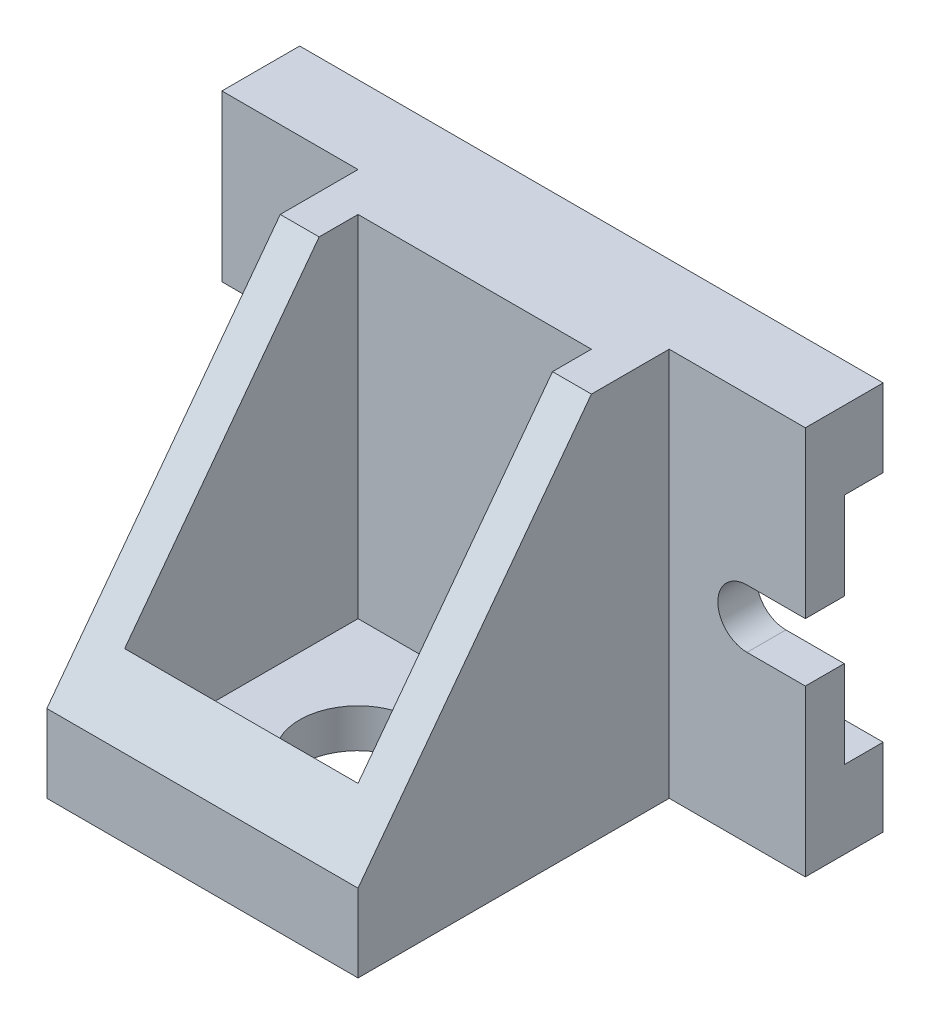
ISO-10303-21;
HEADER;
FILE_DESCRIPTION(('STEP AP214'),'2;1');
FILE_NAME('part.step','',(''),(''),'','','');
FILE_SCHEMA(('AUTOMOTIVE_DESIGN { 1 0 10303 214 1 1 1 1 }'));
ENDSEC;
DATA;
#1=APPLICATION_CONTEXT('core data for automotive mechanical design processes');
#2=APPLICATION_PROTOCOL_DEFINITION('international standard','automotive_design',2000,#1);
#3=PRODUCT_CONTEXT('',#1,'mechanical');
#4=PRODUCT('Part','Part','',(#3));
#5=PRODUCT_RELATED_PRODUCT_CATEGORY('part','',(#4));
#6=PRODUCT_DEFINITION_FORMATION('','',#4);
#7=PRODUCT_DEFINITION_CONTEXT('part definition',#1,'design');
#8=PRODUCT_DEFINITION('design','',#6,#7);
#9=PRODUCT_DEFINITION_SHAPE('','',#8);
#10=(LENGTH_UNIT() NAMED_UNIT(*) SI_UNIT(.MILLI.,.METRE.));
#11=(NAMED_UNIT(*) PLANE_ANGLE_UNIT() SI_UNIT($,.RADIAN.));
#12=(NAMED_UNIT(*) SI_UNIT($,.STERADIAN.) SOLID_ANGLE_UNIT());
#13=UNCERTAINTY_MEASURE_WITH_UNIT(LENGTH_MEASURE(1.E-05),#10,'distance_accuracy_value','');
#14=(GEOMETRIC_REPRESENTATION_CONTEXT(3) GLOBAL_UNCERTAINTY_ASSIGNED_CONTEXT((#13)) GLOBAL_UNIT_ASSIGNED_CONTEXT((#10,
#11,#12)) REPRESENTATION_CONTEXT('',''));
#15=CARTESIAN_POINT('',(0.,0.,0.));
#16=DIRECTION('',(0.,0.,1.));
#17=DIRECTION('',(1.,0.,0.));
#18=AXIS2_PLACEMENT_3D('',#15,#16,#17);
#19=CARTESIAN_POINT('',(-75.,-7.5,20.));
#20=DIRECTION('',(1.,0.,0.));
#21=DIRECTION('',(0.,0.,-1.));
#22=AXIS2_PLACEMENT_3D('',#19,#20,#21);
#23=PLANE('',#22);
#24=DIRECTION('',(0.,0.,-1.));
#25=VECTOR('',#24,1.);
#26=CARTESIAN_POINT('',(-75.,-50.,20.));
#27=LINE('',#26,#25);
#28=CARTESIAN_POINT('',(-75.,-50.,20.));
#29=VERTEX_POINT('',#28);
#30=CARTESIAN_POINT('',(-75.,-50.,0.));
#31=VERTEX_POINT('',#30);
#32=EDGE_CURVE('E446',#29,#31,#27,.T.);
#33=ORIENTED_EDGE('',*,*,#32,.F.);
#34=DIRECTION('',(0.,-1.,0.));
#35=VECTOR('',#34,1.);
#36=CARTESIAN_POINT('',(-75.,50.,20.));
#37=LINE('',#36,#35);
#38=CARTESIAN_POINT('',(-75.,-7.5,20.));
#39=VERTEX_POINT('',#38);
#40=EDGE_CURVE('E276',#39,#29,#37,.T.);
#41=ORIENTED_EDGE('',*,*,#40,.F.);
#42=DIRECTION('',(0.,0.,-1.));
#43=VECTOR('',#42,1.);
#44=CARTESIAN_POINT('',(-75.,-7.5,20.));
#45=LINE('',#44,#43);
#46=CARTESIAN_POINT('',(-75.,-7.5,10.));
#47=VERTEX_POINT('',#46);
#48=EDGE_CURVE('E449',#39,#47,#45,.T.);
#49=ORIENTED_EDGE('',*,*,#48,.T.);
#50=DIRECTION('',(0.,-1.,0.));
#51=VECTOR('',#50,1.);
#52=CARTESIAN_POINT('',(-75.,-7.5,10.));
#53=LINE('',#52,#51);
#54=CARTESIAN_POINT('',(-75.,-30.,10.));
#55=VERTEX_POINT('',#54);
#56=EDGE_CURVE('E487',#47,#55,#53,.T.);
#57=ORIENTED_EDGE('',*,*,#56,.T.);
#58=DIRECTION('',(0.,0.,-1.));
#59=VECTOR('',#58,1.);
#60=CARTESIAN_POINT('',(-75.,-30.,20.));
#61=LINE('',#60,#59);
#62=CARTESIAN_POINT('',(-75.,-30.,0.));
#63=VERTEX_POINT('',#62);
#64=EDGE_CURVE('E369',#55,#63,#61,.T.);
#65=ORIENTED_EDGE('',*,*,#64,.T.);
#66=DIRECTION('',(0.,-1.,0.));
#67=VECTOR('',#66,1.);
#68=CARTESIAN_POINT('',(-75.,-7.5,0.));
#69=LINE('',#68,#67);
#70=EDGE_CURVE('E437',#63,#31,#69,.T.);
#71=ORIENTED_EDGE('',*,*,#70,.T.);
#72=EDGE_LOOP('',(#33,#41,#49,#57,#65,#71));
#73=FACE_BOUND('',#72,.T.);
#74=ADVANCED_FACE('F47',(#73),#23,.F.);
#75=CARTESIAN_POINT('',(-75.,-50.,100.));
#76=DIRECTION('',(0.,0.,1.));
#77=DIRECTION('',(1.,0.,0.));
#78=AXIS2_PLACEMENT_3D('',#75,#76,#77);
#79=PLANE('',#78);
#80=DIRECTION('',(1.,0.,0.));
#81=VECTOR('',#80,1.);
#82=CARTESIAN_POINT('',(-75.,-30.,100.));
#83=LINE('',#82,#81);
#84=CARTESIAN_POINT('',(-40.,-30.,100.));
#85=VERTEX_POINT('',#84);
#86=CARTESIAN_POINT('',(40.,-30.,100.));
#87=VERTEX_POINT('',#86);
#88=EDGE_CURVE('E330',#85,#87,#83,.T.);
#89=ORIENTED_EDGE('',*,*,#88,.F.);
#90=DIRECTION('',(0.,1.,0.));
#91=VECTOR('',#90,1.);
#92=CARTESIAN_POINT('',(-40.,50.,100.));
#93=LINE('',#92,#91);
#94=CARTESIAN_POINT('',(-40.,-50.,100.));
#95=VERTEX_POINT('',#94);
#96=EDGE_CURVE('E72',#95,#85,#93,.T.);
#97=ORIENTED_EDGE('',*,*,#96,.F.);
#98=DIRECTION('',(1.,0.,0.));
#99=VECTOR('',#98,1.);
#100=CARTESIAN_POINT('',(-75.,-50.,100.));
#101=LINE('',#100,#99);
#102=CARTESIAN_POINT('',(40.,-50.,100.));
#103=VERTEX_POINT('',#102);
#104=EDGE_CURVE('E326',#95,#103,#101,.T.);
#105=ORIENTED_EDGE('',*,*,#104,.T.);
#106=DIRECTION('',(0.,-1.,0.));
#107=VECTOR('',#106,1.);
#108=CARTESIAN_POINT('',(40.,50.,100.));
#109=LINE('',#108,#107);
#110=EDGE_CURVE('E307',#87,#103,#109,.T.);
#111=ORIENTED_EDGE('',*,*,#110,.F.);
#112=EDGE_LOOP('',(#89,#97,#105,#111));
#113=FACE_BOUND('',#112,.T.);
#114=ADVANCED_FACE('F594',(#113),#79,.T.);
#115=CARTESIAN_POINT('',(-75.,-30.,100.));
#116=DIRECTION('',(0.,0.6,0.8));
#117=DIRECTION('',(0.,-0.8,0.6));
#118=AXIS2_PLACEMENT_3D('',#115,#116,#117);
#119=PLANE('',#118);
#120=DIRECTION('',(0.,-0.8,0.6));
#121=VECTOR('',#120,1.);
#122=CARTESIAN_POINT('',(-30.,-30.,100.));
#123=LINE('',#122,#121);
#124=CARTESIAN_POINT('',(-30.,50.,40.));
#125=VERTEX_POINT('',#124);
#126=CARTESIAN_POINT('',(-30.,-16.6666666666666,90.));
#127=VERTEX_POINT('',#126);
#128=EDGE_CURVE('E229',#125,#127,#123,.T.);
#129=ORIENTED_EDGE('',*,*,#128,.F.);
#130=DIRECTION('',(1.,0.,0.));
#131=VECTOR('',#130,1.);
#132=CARTESIAN_POINT('',(-75.,50.,40.));
#133=LINE('',#132,#131);
#134=CARTESIAN_POINT('',(-40.,50.,40.));
#135=VERTEX_POINT('',#134);
#136=EDGE_CURVE('E333',#135,#125,#133,.T.);
#137=ORIENTED_EDGE('',*,*,#136,.F.);
#138=DIRECTION('',(0.,-0.8,0.6));
#139=VECTOR('',#138,1.);
#140=CARTESIAN_POINT('',(-40.,-30.,100.));
#141=LINE('',#140,#139);
#142=EDGE_CURVE('E495',#135,#85,#141,.T.);
#143=ORIENTED_EDGE('',*,*,#142,.T.);
#144=ORIENTED_EDGE('',*,*,#88,.T.);
#145=DIRECTION('',(0.,-0.8,0.6));
#146=VECTOR('',#145,1.);
#147=CARTESIAN_POINT('',(40.,-30.,100.));
#148=LINE('',#147,#146);
#149=CARTESIAN_POINT('',(40.,50.,40.));
#150=VERTEX_POINT('',#149);
#151=EDGE_CURVE('E491',#150,#87,#148,.T.);
#152=ORIENTED_EDGE('',*,*,#151,.F.);
#153=CARTESIAN_POINT('',(30.,50.,40.));
#154=VERTEX_POINT('',#153);
#155=EDGE_CURVE('E337',#154,#150,#133,.T.);
#156=ORIENTED_EDGE('',*,*,#155,.F.);
#157=DIRECTION('',(0.,0.8,-0.6));
#158=VECTOR('',#157,1.);
#159=CARTESIAN_POINT('',(30.,-30.,100.));
#160=LINE('',#159,#158);
#161=CARTESIAN_POINT('',(30.,-16.6666666666666,90.));
#162=VERTEX_POINT('',#161);
#163=EDGE_CURVE('E64',#162,#154,#160,.T.);
#164=ORIENTED_EDGE('',*,*,#163,.F.);
#165=DIRECTION('',(1.,0.,0.));
#166=VECTOR('',#165,1.);
#167=CARTESIAN_POINT('',(-75.,-16.6666666666666,90.));
#168=LINE('',#167,#166);
#169=EDGE_CURVE('E11',#127,#162,#168,.T.);
#170=ORIENTED_EDGE('',*,*,#169,.F.);
#171=EDGE_LOOP('',(#129,#137,#143,#144,#152,#156,#164,#170));
#172=FACE_BOUND('',#171,.T.);
#173=ADVANCED_FACE('F507',(#172),#119,.T.);
#174=CARTESIAN_POINT('',(75.,50.,20.));
#175=DIRECTION('',(-1.,0.,0.));
#176=DIRECTION('',(0.,0.,1.));
#177=AXIS2_PLACEMENT_3D('',#174,#175,#176);
#178=PLANE('',#177);
#179=DIRECTION('',(0.,1.,0.));
#180=VECTOR('',#179,1.);
#181=CARTESIAN_POINT('',(75.,50.,20.));
#182=LINE('',#181,#180);
#183=CARTESIAN_POINT('',(75.,-50.,20.));
#184=VERTEX_POINT('',#183);
#185=CARTESIAN_POINT('',(75.,-7.5,20.));
#186=VERTEX_POINT('',#185);
#187=EDGE_CURVE('E325',#184,#186,#182,.T.);
#188=ORIENTED_EDGE('',*,*,#187,.F.);
#189=DIRECTION('',(0.,0.,-1.));
#190=VECTOR('',#189,1.);
#191=CARTESIAN_POINT('',(75.,-50.,20.));
#192=LINE('',#191,#190);
#193=CARTESIAN_POINT('',(75.,-50.,0.));
#194=VERTEX_POINT('',#193);
#195=EDGE_CURVE('E421',#184,#194,#192,.T.);
#196=ORIENTED_EDGE('',*,*,#195,.T.);
#197=DIRECTION('',(0.,1.,0.));
#198=VECTOR('',#197,1.);
#199=CARTESIAN_POINT('',(75.,-7.5,0.));
#200=LINE('',#199,#198);
#201=CARTESIAN_POINT('',(75.,-30.,0.));
#202=VERTEX_POINT('',#201);
#203=EDGE_CURVE('E401',#194,#202,#200,.T.);
#204=ORIENTED_EDGE('',*,*,#203,.T.);
#205=DIRECTION('',(0.,0.,1.));
#206=VECTOR('',#205,1.);
#207=CARTESIAN_POINT('',(75.,-30.,0.));
#208=LINE('',#207,#206);
#209=CARTESIAN_POINT('',(75.,-30.,10.));
#210=VERTEX_POINT('',#209);
#211=EDGE_CURVE('E346',#202,#210,#208,.T.);
#212=ORIENTED_EDGE('',*,*,#211,.T.);
#213=DIRECTION('',(0.,1.,0.));
#214=VECTOR('',#213,1.);
#215=CARTESIAN_POINT('',(75.,30.,10.));
#216=LINE('',#215,#214);
#217=CARTESIAN_POINT('',(75.,-7.5,10.));
#218=VERTEX_POINT('',#217);
#219=EDGE_CURVE('E338',#210,#218,#216,.T.);
#220=ORIENTED_EDGE('',*,*,#219,.T.);
#221=DIRECTION('',(0.,0.,-1.));
#222=VECTOR('',#221,1.);
#223=CARTESIAN_POINT('',(75.,-7.5,20.));
#224=LINE('',#223,#222);
#225=EDGE_CURVE('E483',#186,#218,#224,.T.);
#226=ORIENTED_EDGE('',*,*,#225,.F.);
#227=EDGE_LOOP('',(#188,#196,#204,#212,#220,#226));
#228=FACE_BOUND('',#227,.T.);
#229=ADVANCED_FACE('F520',(#228),#178,.F.);
#230=CARTESIAN_POINT('',(75.,7.5,20.));
#231=VERTEX_POINT('',#230);
#232=CARTESIAN_POINT('',(75.,50.,20.));
#233=VERTEX_POINT('',#232);
#234=EDGE_CURVE('E322',#231,#233,#182,.T.);
#235=ORIENTED_EDGE('',*,*,#234,.F.);
#236=DIRECTION('',(0.,0.,-1.));
#237=VECTOR('',#236,1.);
#238=CARTESIAN_POINT('',(75.,7.5,20.));
#239=LINE('',#238,#237);
#240=CARTESIAN_POINT('',(75.,7.5,10.));
#241=VERTEX_POINT('',#240);
#242=EDGE_CURVE('E471',#231,#241,#239,.T.);
#243=ORIENTED_EDGE('',*,*,#242,.T.);
#244=CARTESIAN_POINT('',(75.,30.,10.));
#245=VERTEX_POINT('',#244);
#246=EDGE_CURVE('E329',#241,#245,#216,.T.);
#247=ORIENTED_EDGE('',*,*,#246,.T.);
#248=DIRECTION('',(0.,0.,-1.));
#249=VECTOR('',#248,1.);
#250=CARTESIAN_POINT('',(75.,30.,0.));
#251=LINE('',#250,#249);
#252=CARTESIAN_POINT('',(75.,30.,0.));
#253=VERTEX_POINT('',#252);
#254=EDGE_CURVE('E342',#245,#253,#251,.T.);
#255=ORIENTED_EDGE('',*,*,#254,.T.);
#256=DIRECTION('',(0.,1.,0.));
#257=VECTOR('',#256,1.);
#258=CARTESIAN_POINT('',(75.,50.,0.));
#259=LINE('',#258,#257);
#260=CARTESIAN_POINT('',(75.,50.,0.));
#261=VERTEX_POINT('',#260);
#262=EDGE_CURVE('E425',#253,#261,#259,.T.);
#263=ORIENTED_EDGE('',*,*,#262,.T.);
#264=DIRECTION('',(0.,0.,-1.));
#265=VECTOR('',#264,1.);
#266=CARTESIAN_POINT('',(75.,50.,20.));
#267=LINE('',#266,#265);
#268=EDGE_CURVE('E468',#233,#261,#267,.T.);
#269=ORIENTED_EDGE('',*,*,#268,.F.);
#270=EDGE_LOOP('',(#235,#243,#247,#255,#263,#269));
#271=FACE_BOUND('',#270,.T.);
#272=ADVANCED_FACE('F534',(#271),#178,.F.);
#273=CARTESIAN_POINT('',(-75.,50.,20.));
#274=DIRECTION('',(0.,-1.,0.));
#275=DIRECTION('',(0.,0.,-1.));
#276=AXIS2_PLACEMENT_3D('',#273,#274,#275);
#277=PLANE('',#276);
#278=ORIENTED_EDGE('',*,*,#136,.T.);
#279=DIRECTION('',(0.,0.,1.));
#280=VECTOR('',#279,1.);
#281=CARTESIAN_POINT('',(-30.,50.,30.));
#282=LINE('',#281,#280);
#283=CARTESIAN_POINT('',(-30.,50.,30.));
#284=VERTEX_POINT('',#283);
#285=EDGE_CURVE('E252',#284,#125,#282,.T.);
#286=ORIENTED_EDGE('',*,*,#285,.F.);
#287=DIRECTION('',(-1.,0.,0.));
#288=VECTOR('',#287,1.);
#289=CARTESIAN_POINT('',(-30.,50.,30.));
#290=LINE('',#289,#288);
#291=CARTESIAN_POINT('',(30.,50.,30.));
#292=VERTEX_POINT('',#291);
#293=EDGE_CURVE('E248',#292,#284,#290,.T.);
#294=ORIENTED_EDGE('',*,*,#293,.F.);
#295=DIRECTION('',(0.,0.,1.));
#296=VECTOR('',#295,1.);
#297=CARTESIAN_POINT('',(30.,50.,20.));
#298=LINE('',#297,#296);
#299=EDGE_CURVE('E57',#292,#154,#298,.T.);
#300=ORIENTED_EDGE('',*,*,#299,.T.);
#301=ORIENTED_EDGE('',*,*,#155,.T.);
#302=DIRECTION('',(0.,0.,1.));
#303=VECTOR('',#302,1.);
#304=CARTESIAN_POINT('',(40.,50.,20.));
#305=LINE('',#304,#303);
#306=CARTESIAN_POINT('',(40.,50.,20.));
#307=VERTEX_POINT('',#306);
#308=EDGE_CURVE('E303',#307,#150,#305,.T.);
#309=ORIENTED_EDGE('',*,*,#308,.F.);
#310=DIRECTION('',(-1.,0.,0.));
#311=VECTOR('',#310,1.);
#312=CARTESIAN_POINT('',(75.000012,50.,20.));
#313=LINE('',#312,#311);
#314=EDGE_CURVE('E319',#233,#307,#313,.T.);
#315=ORIENTED_EDGE('',*,*,#314,.F.);
#316=ORIENTED_EDGE('',*,*,#268,.T.);
#317=DIRECTION('',(-1.,0.,0.));
#318=VECTOR('',#317,1.);
#319=CARTESIAN_POINT('',(-75.,50.,0.));
#320=LINE('',#319,#318);
#321=CARTESIAN_POINT('',(-75.,50.,0.));
#322=VERTEX_POINT('',#321);
#323=EDGE_CURVE('E429',#261,#322,#320,.T.);
#324=ORIENTED_EDGE('',*,*,#323,.T.);
#325=DIRECTION('',(0.,0.,-1.));
#326=VECTOR('',#325,1.);
#327=CARTESIAN_POINT('',(-75.,50.,20.));
#328=LINE('',#327,#326);
#329=CARTESIAN_POINT('',(-75.,50.,20.));
#330=VERTEX_POINT('',#329);
#331=EDGE_CURVE('E465',#330,#322,#328,.T.);
#332=ORIENTED_EDGE('',*,*,#331,.F.);
#333=DIRECTION('',(-1.,0.,0.));
#334=VECTOR('',#333,1.);
#335=CARTESIAN_POINT('',(-40.,50.,20.));
#336=LINE('',#335,#334);
#337=CARTESIAN_POINT('',(-40.,50.,20.));
#338=VERTEX_POINT('',#337);
#339=EDGE_CURVE('E293',#338,#330,#336,.T.);
#340=ORIENTED_EDGE('',*,*,#339,.F.);
#341=DIRECTION('',(0.,0.,-1.));
#342=VECTOR('',#341,1.);
#343=CARTESIAN_POINT('',(-40.,50.,20.));
#344=LINE('',#343,#342);
#345=EDGE_CURVE('E287',#135,#338,#344,.T.);
#346=ORIENTED_EDGE('',*,*,#345,.F.);
#347=EDGE_LOOP('',(#278,#286,#294,#300,#301,#309,#315,#316,#324,#332,#340,#346));
#348=FACE_BOUND('',#347,.T.);
#349=ADVANCED_FACE('F502',(#348),#277,.F.);
#350=CARTESIAN_POINT('',(-75.,-50.,20.));
#351=DIRECTION('',(0.,1.,0.));
#352=DIRECTION('',(0.,0.,1.));
#353=AXIS2_PLACEMENT_3D('',#350,#351,#352);
#354=PLANE('',#353);
#355=CARTESIAN_POINT('',(0.,-50.,60.));
#356=DIRECTION('',(0.,1.,0.));
#357=DIRECTION('',(0.,0.,1.));
#358=AXIS2_PLACEMENT_3D('',#355,#356,#357);
#359=CIRCLE('',#358,15.);
#360=CARTESIAN_POINT('',(0.,-50.,75.));
#361=VERTEX_POINT('',#360);
#362=EDGE_CURVE('E255',#361,#361,#359,.T.);
#363=ORIENTED_EDGE('',*,*,#362,.T.);
#364=EDGE_LOOP('',(#363));
#365=FACE_BOUND('',#364,.T.);
#366=DIRECTION('',(0.,0.,1.));
#367=VECTOR('',#366,1.);
#368=CARTESIAN_POINT('',(-40.,-50.,20.));
#369=LINE('',#368,#367);
#370=CARTESIAN_POINT('',(-40.,-50.,20.));
#371=VERTEX_POINT('',#370);
#372=EDGE_CURVE('E281',#371,#95,#369,.T.);
#373=ORIENTED_EDGE('',*,*,#372,.F.);
#374=DIRECTION('',(-1.,0.,0.));
#375=VECTOR('',#374,1.);
#376=CARTESIAN_POINT('',(-40.,-50.,20.));
#377=LINE('',#376,#375);
#378=EDGE_CURVE('E290',#371,#29,#377,.T.);
#379=ORIENTED_EDGE('',*,*,#378,.T.);
#380=ORIENTED_EDGE('',*,*,#32,.T.);
#381=DIRECTION('',(1.,0.,0.));
#382=VECTOR('',#381,1.);
#383=CARTESIAN_POINT('',(-75.,-50.,0.));
#384=LINE('',#383,#382);
#385=EDGE_CURVE('E406',#31,#194,#384,.T.);
#386=ORIENTED_EDGE('',*,*,#385,.T.);
#387=ORIENTED_EDGE('',*,*,#195,.F.);
#388=DIRECTION('',(-1.,0.,0.));
#389=VECTOR('',#388,1.);
#390=CARTESIAN_POINT('',(75.000012,-50.,20.));
#391=LINE('',#390,#389);
#392=CARTESIAN_POINT('',(40.,-50.,20.));
#393=VERTEX_POINT('',#392);
#394=EDGE_CURVE('E315',#184,#393,#391,.T.);
#395=ORIENTED_EDGE('',*,*,#394,.T.);
#396=DIRECTION('',(0.,0.,-1.));
#397=VECTOR('',#396,1.);
#398=CARTESIAN_POINT('',(40.,-50.,20.));
#399=LINE('',#398,#397);
#400=EDGE_CURVE('E311',#103,#393,#399,.T.);
#401=ORIENTED_EDGE('',*,*,#400,.F.);
#402=ORIENTED_EDGE('',*,*,#104,.F.);
#403=EDGE_LOOP('',(#373,#379,#380,#386,#387,#395,#401,#402));
#404=FACE_BOUND('',#403,.T.);
#405=ADVANCED_FACE('F554',(#365,#404),#354,.F.);
#406=CARTESIAN_POINT('',(-60.,0.,0.));
#407=DIRECTION('',(0.,0.,1.));
#408=DIRECTION('',(1.,0.,0.));
#409=AXIS2_PLACEMENT_3D('',#406,#407,#408);
#410=PLANE('',#409);
#411=ORIENTED_EDGE('',*,*,#70,.F.);
#412=DIRECTION('',(-1.,0.,0.));
#413=VECTOR('',#412,1.);
#414=CARTESIAN_POINT('',(75.,-30.,0.));
#415=LINE('',#414,#413);
#416=EDGE_CURVE('E356',#202,#63,#415,.T.);
#417=ORIENTED_EDGE('',*,*,#416,.F.);
#418=ORIENTED_EDGE('',*,*,#203,.F.);
#419=ORIENTED_EDGE('',*,*,#385,.F.);
#420=EDGE_LOOP('',(#411,#417,#418,#419));
#421=FACE_BOUND('',#420,.T.);
#422=ADVANCED_FACE('F560',(#421),#410,.F.);
#423=CARTESIAN_POINT('',(60.,-7.5,20.));
#424=DIRECTION('',(0.,-1.,0.));
#425=DIRECTION('',(1.,0.,0.));
#426=AXIS2_PLACEMENT_3D('',#423,#424,#425);
#427=PLANE('',#426);
#428=ORIENTED_EDGE('',*,*,#225,.T.);
#429=DIRECTION('',(-1.,0.,0.));
#430=VECTOR('',#429,1.);
#431=CARTESIAN_POINT('',(60.,-7.5,10.));
#432=LINE('',#431,#430);
#433=CARTESIAN_POINT('',(60.,-7.5,10.));
#434=VERTEX_POINT('',#433);
#435=EDGE_CURVE('E397',#218,#434,#432,.T.);
#436=ORIENTED_EDGE('',*,*,#435,.T.);
#437=DIRECTION('',(0.,0.,-1.));
#438=VECTOR('',#437,1.);
#439=CARTESIAN_POINT('',(60.,-7.5,20.));
#440=LINE('',#439,#438);
#441=CARTESIAN_POINT('',(60.,-7.5,20.));
#442=VERTEX_POINT('',#441);
#443=EDGE_CURVE('E479',#442,#434,#440,.T.);
#444=ORIENTED_EDGE('',*,*,#443,.F.);
#445=DIRECTION('',(-1.,0.,0.));
#446=VECTOR('',#445,1.);
#447=CARTESIAN_POINT('',(60.,-7.5,20.));
#448=LINE('',#447,#446);
#449=EDGE_CURVE('E402',#186,#442,#448,.T.);
#450=ORIENTED_EDGE('',*,*,#449,.F.);
#451=EDGE_LOOP('',(#428,#436,#444,#450));
#452=FACE_BOUND('',#451,.T.);
#453=ADVANCED_FACE('F49',(#452),#427,.F.);
#454=CARTESIAN_POINT('',(60.,0.,20.));
#455=DIRECTION('',(0.,0.,-1.));
#456=DIRECTION('',(-1.,0.,0.));
#457=AXIS2_PLACEMENT_3D('',#454,#455,#456);
#458=CYLINDRICAL_SURFACE('',#457,7.5);
#459=ORIENTED_EDGE('',*,*,#443,.T.);
#460=CARTESIAN_POINT('',(60.,0.,10.));
#461=DIRECTION('',(0.,0.,1.));
#462=DIRECTION('',(0.,-1.,0.));
#463=AXIS2_PLACEMENT_3D('',#460,#461,#462);
#464=CIRCLE('',#463,7.5);
#465=CARTESIAN_POINT('',(60.,7.5,10.));
#466=VERTEX_POINT('',#465);
#467=EDGE_CURVE('E393',#434,#466,#464,.F.);
#468=ORIENTED_EDGE('',*,*,#467,.T.);
#469=DIRECTION('',(0.,0.,-1.));
#470=VECTOR('',#469,1.);
#471=CARTESIAN_POINT('',(60.,7.5,20.));
#472=LINE('',#471,#470);
#473=CARTESIAN_POINT('',(60.,7.5,20.));
#474=VERTEX_POINT('',#473);
#475=EDGE_CURVE('E475',#474,#466,#472,.T.);
#476=ORIENTED_EDGE('',*,*,#475,.F.);
#477=CARTESIAN_POINT('',(60.,0.,20.));
#478=DIRECTION('',(0.,0.,-1.));
#479=DIRECTION('',(-1.,0.,0.));
#480=AXIS2_PLACEMENT_3D('',#477,#478,#479);
#481=CIRCLE('',#480,7.5);
#482=EDGE_CURVE('E405',#442,#474,#481,.T.);
#483=ORIENTED_EDGE('',*,*,#482,.F.);
#484=EDGE_LOOP('',(#459,#468,#476,#483));
#485=FACE_BOUND('',#484,.T.);
#486=ADVANCED_FACE('F525',(#485),#458,.F.);
#487=CARTESIAN_POINT('',(60.,7.5,20.));
#488=DIRECTION('',(0.,1.,0.));
#489=DIRECTION('',(-1.,0.,0.));
#490=AXIS2_PLACEMENT_3D('',#487,#488,#489);
#491=PLANE('',#490);
#492=ORIENTED_EDGE('',*,*,#475,.T.);
#493=DIRECTION('',(1.,0.,0.));
#494=VECTOR('',#493,1.);
#495=CARTESIAN_POINT('',(60.,7.5,10.));
#496=LINE('',#495,#494);
#497=EDGE_CURVE('E389',#466,#241,#496,.T.);
#498=ORIENTED_EDGE('',*,*,#497,.T.);
#499=ORIENTED_EDGE('',*,*,#242,.F.);
#500=DIRECTION('',(1.,0.,0.));
#501=VECTOR('',#500,1.);
#502=CARTESIAN_POINT('',(60.,7.5,20.));
#503=LINE('',#502,#501);
#504=EDGE_CURVE('E409',#474,#231,#503,.T.);
#505=ORIENTED_EDGE('',*,*,#504,.F.);
#506=EDGE_LOOP('',(#492,#498,#499,#505));
#507=FACE_BOUND('',#506,.T.);
#508=ADVANCED_FACE('F536',(#507),#491,.F.);
#509=CARTESIAN_POINT('',(-60.,7.5,20.));
#510=DIRECTION('',(0.,1.,0.));
#511=DIRECTION('',(-1.,0.,0.));
#512=AXIS2_PLACEMENT_3D('',#509,#510,#511);
#513=PLANE('',#512);
#514=DIRECTION('',(0.,0.,-1.));
#515=VECTOR('',#514,1.);
#516=CARTESIAN_POINT('',(-75.,7.5,20.));
#517=LINE('',#516,#515);
#518=CARTESIAN_POINT('',(-75.,7.5,20.));
#519=VERTEX_POINT('',#518);
#520=CARTESIAN_POINT('',(-75.,7.5,10.));
#521=VERTEX_POINT('',#520);
#522=EDGE_CURVE('E461',#519,#521,#517,.T.);
#523=ORIENTED_EDGE('',*,*,#522,.T.);
#524=DIRECTION('',(1.,0.,0.));
#525=VECTOR('',#524,1.);
#526=CARTESIAN_POINT('',(-60.,7.5,10.));
#527=LINE('',#526,#525);
#528=CARTESIAN_POINT('',(-60.,7.5,10.));
#529=VERTEX_POINT('',#528);
#530=EDGE_CURVE('E381',#521,#529,#527,.T.);
#531=ORIENTED_EDGE('',*,*,#530,.T.);
#532=DIRECTION('',(0.,0.,-1.));
#533=VECTOR('',#532,1.);
#534=CARTESIAN_POINT('',(-60.,7.5,20.));
#535=LINE('',#534,#533);
#536=CARTESIAN_POINT('',(-60.,7.5,20.));
#537=VERTEX_POINT('',#536);
#538=EDGE_CURVE('E457',#537,#529,#535,.T.);
#539=ORIENTED_EDGE('',*,*,#538,.F.);
#540=DIRECTION('',(1.,0.,0.));
#541=VECTOR('',#540,1.);
#542=CARTESIAN_POINT('',(-60.,7.5,20.));
#543=LINE('',#542,#541);
#544=EDGE_CURVE('E412',#519,#537,#543,.T.);
#545=ORIENTED_EDGE('',*,*,#544,.F.);
#546=EDGE_LOOP('',(#523,#531,#539,#545));
#547=FACE_BOUND('',#546,.T.);
#548=ADVANCED_FACE('F576',(#547),#513,.F.);
#549=CARTESIAN_POINT('',(-60.,0.,20.));
#550=DIRECTION('',(0.,0.,-1.));
#551=DIRECTION('',(-1.,0.,0.));
#552=AXIS2_PLACEMENT_3D('',#549,#550,#551);
#553=CYLINDRICAL_SURFACE('',#552,7.5);
#554=ORIENTED_EDGE('',*,*,#538,.T.);
#555=CARTESIAN_POINT('',(-60.,0.,10.));
#556=DIRECTION('',(0.,0.,1.));
#557=DIRECTION('',(0.,-1.,0.));
#558=AXIS2_PLACEMENT_3D('',#555,#556,#557);
#559=CIRCLE('',#558,7.5);
#560=CARTESIAN_POINT('',(-60.,-7.5,10.));
#561=VERTEX_POINT('',#560);
#562=EDGE_CURVE('E377',#529,#561,#559,.F.);
#563=ORIENTED_EDGE('',*,*,#562,.T.);
#564=DIRECTION('',(0.,0.,-1.));
#565=VECTOR('',#564,1.);
#566=CARTESIAN_POINT('',(-60.,-7.5,20.));
#567=LINE('',#566,#565);
#568=CARTESIAN_POINT('',(-60.,-7.5,20.));
#569=VERTEX_POINT('',#568);
#570=EDGE_CURVE('E453',#569,#561,#567,.T.);
#571=ORIENTED_EDGE('',*,*,#570,.F.);
#572=CARTESIAN_POINT('',(-60.,0.,20.));
#573=DIRECTION('',(0.,0.,-1.));
#574=DIRECTION('',(1.,0.,0.));
#575=AXIS2_PLACEMENT_3D('',#572,#573,#574);
#576=CIRCLE('',#575,7.5);
#577=EDGE_CURVE('E415',#537,#569,#576,.T.);
#578=ORIENTED_EDGE('',*,*,#577,.F.);
#579=EDGE_LOOP('',(#554,#563,#571,#578));
#580=FACE_BOUND('',#579,.T.);
#581=ADVANCED_FACE('F573',(#580),#553,.F.);
#582=CARTESIAN_POINT('',(-60.,-7.5,20.));
#583=DIRECTION('',(0.,-1.,0.));
#584=DIRECTION('',(1.,0.,0.));
#585=AXIS2_PLACEMENT_3D('',#582,#583,#584);
#586=PLANE('',#585);
#587=ORIENTED_EDGE('',*,*,#570,.T.);
#588=DIRECTION('',(-1.,0.,0.));
#589=VECTOR('',#588,1.);
#590=CARTESIAN_POINT('',(-60.,-7.5,10.));
#591=LINE('',#590,#589);
#592=EDGE_CURVE('E373',#561,#47,#591,.T.);
#593=ORIENTED_EDGE('',*,*,#592,.T.);
#594=ORIENTED_EDGE('',*,*,#48,.F.);
#595=DIRECTION('',(-1.,0.,0.));
#596=VECTOR('',#595,1.);
#597=CARTESIAN_POINT('',(-60.,-7.5,20.));
#598=LINE('',#597,#596);
#599=EDGE_CURVE('E418',#569,#39,#598,.T.);
#600=ORIENTED_EDGE('',*,*,#599,.F.);
#601=EDGE_LOOP('',(#587,#593,#594,#600));
#602=FACE_BOUND('',#601,.T.);
#603=ADVANCED_FACE('F568',(#602),#586,.F.);
#604=ORIENTED_EDGE('',*,*,#522,.F.);
#605=EDGE_CURVE('E282',#330,#519,#37,.T.);
#606=ORIENTED_EDGE('',*,*,#605,.F.);
#607=ORIENTED_EDGE('',*,*,#331,.T.);
#608=DIRECTION('',(0.,-1.,0.));
#609=VECTOR('',#608,1.);
#610=CARTESIAN_POINT('',(-75.,50.,0.));
#611=LINE('',#610,#609);
#612=CARTESIAN_POINT('',(-75.,30.,0.));
#613=VERTEX_POINT('',#612);
#614=EDGE_CURVE('E433',#322,#613,#611,.T.);
#615=ORIENTED_EDGE('',*,*,#614,.T.);
#616=DIRECTION('',(0.,0.,1.));
#617=VECTOR('',#616,1.);
#618=CARTESIAN_POINT('',(-75.,30.,20.));
#619=LINE('',#618,#617);
#620=CARTESIAN_POINT('',(-75.,30.,10.));
#621=VERTEX_POINT('',#620);
#622=EDGE_CURVE('E355',#613,#621,#619,.T.);
#623=ORIENTED_EDGE('',*,*,#622,.T.);
#624=DIRECTION('',(0.,-1.,0.));
#625=VECTOR('',#624,1.);
#626=CARTESIAN_POINT('',(-75.,50.,10.));
#627=LINE('',#626,#625);
#628=EDGE_CURVE('E385',#621,#521,#627,.T.);
#629=ORIENTED_EDGE('',*,*,#628,.T.);
#630=EDGE_LOOP('',(#604,#606,#607,#615,#623,#629));
#631=FACE_BOUND('',#630,.T.);
#632=ADVANCED_FACE('F581',(#631),#23,.F.);
#633=ORIENTED_EDGE('',*,*,#262,.F.);
#634=DIRECTION('',(-1.,0.,0.));
#635=VECTOR('',#634,1.);
#636=CARTESIAN_POINT('',(75.,30.,0.));
#637=LINE('',#636,#635);
#638=EDGE_CURVE('E359',#253,#613,#637,.T.);
#639=ORIENTED_EDGE('',*,*,#638,.T.);
#640=ORIENTED_EDGE('',*,*,#614,.F.);
#641=ORIENTED_EDGE('',*,*,#323,.F.);
#642=EDGE_LOOP('',(#633,#639,#640,#641));
#643=FACE_BOUND('',#642,.T.);
#644=ADVANCED_FACE('F543',(#643),#410,.F.);
#645=CARTESIAN_POINT('',(75.,30.,10.));
#646=DIRECTION('',(0.,0.,1.));
#647=DIRECTION('',(0.,-1.,0.));
#648=AXIS2_PLACEMENT_3D('',#645,#646,#647);
#649=PLANE('',#648);
#650=ORIENTED_EDGE('',*,*,#219,.F.);
#651=DIRECTION('',(-1.,0.,0.));
#652=VECTOR('',#651,1.);
#653=CARTESIAN_POINT('',(75.,-30.,10.));
#654=LINE('',#653,#652);
#655=EDGE_CURVE('E351',#210,#55,#654,.T.);
#656=ORIENTED_EDGE('',*,*,#655,.T.);
#657=ORIENTED_EDGE('',*,*,#56,.F.);
#658=ORIENTED_EDGE('',*,*,#592,.F.);
#659=ORIENTED_EDGE('',*,*,#562,.F.);
#660=ORIENTED_EDGE('',*,*,#530,.F.);
#661=ORIENTED_EDGE('',*,*,#628,.F.);
#662=DIRECTION('',(-1.,0.,0.));
#663=VECTOR('',#662,1.);
#664=CARTESIAN_POINT('',(75.,30.,10.));
#665=LINE('',#664,#663);
#666=EDGE_CURVE('E350',#245,#621,#665,.T.);
#667=ORIENTED_EDGE('',*,*,#666,.F.);
#668=ORIENTED_EDGE('',*,*,#246,.F.);
#669=ORIENTED_EDGE('',*,*,#497,.F.);
#670=ORIENTED_EDGE('',*,*,#467,.F.);
#671=ORIENTED_EDGE('',*,*,#435,.F.);
#672=EDGE_LOOP('',(#650,#656,#657,#658,#659,#660,#661,#667,#668,#669,#670,#671));
#673=FACE_BOUND('',#672,.T.);
#674=ADVANCED_FACE('F523',(#673),#649,.F.);
#675=CARTESIAN_POINT('',(75.,-30.,0.));
#676=DIRECTION('',(0.,-1.,0.));
#677=DIRECTION('',(0.,0.,-1.));
#678=AXIS2_PLACEMENT_3D('',#675,#676,#677);
#679=PLANE('',#678);
#680=ORIENTED_EDGE('',*,*,#655,.F.);
#681=ORIENTED_EDGE('',*,*,#211,.F.);
#682=ORIENTED_EDGE('',*,*,#416,.T.);
#683=ORIENTED_EDGE('',*,*,#64,.F.);
#684=EDGE_LOOP('',(#680,#681,#682,#683));
#685=FACE_BOUND('',#684,.T.);
#686=ADVANCED_FACE('F562',(#685),#679,.F.);
#687=CARTESIAN_POINT('',(75.,30.,0.));
#688=DIRECTION('',(0.,1.,0.));
#689=DIRECTION('',(0.,0.,1.));
#690=AXIS2_PLACEMENT_3D('',#687,#688,#689);
#691=PLANE('',#690);
#692=ORIENTED_EDGE('',*,*,#638,.F.);
#693=ORIENTED_EDGE('',*,*,#254,.F.);
#694=ORIENTED_EDGE('',*,*,#666,.T.);
#695=ORIENTED_EDGE('',*,*,#622,.F.);
#696=EDGE_LOOP('',(#692,#693,#694,#695));
#697=FACE_BOUND('',#696,.T.);
#698=ADVANCED_FACE('F582',(#697),#691,.F.);
#699=CARTESIAN_POINT('',(75.000012,50.,20.));
#700=DIRECTION('',(0.,0.,1.));
#701=DIRECTION('',(0.,-1.,0.));
#702=AXIS2_PLACEMENT_3D('',#699,#700,#701);
#703=PLANE('',#702);
#704=ORIENTED_EDGE('',*,*,#449,.T.);
#705=ORIENTED_EDGE('',*,*,#482,.T.);
#706=ORIENTED_EDGE('',*,*,#504,.T.);
#707=ORIENTED_EDGE('',*,*,#234,.T.);
#708=ORIENTED_EDGE('',*,*,#314,.T.);
#709=DIRECTION('',(0.,1.,0.));
#710=VECTOR('',#709,1.);
#711=CARTESIAN_POINT('',(40.,50.,20.));
#712=LINE('',#711,#710);
#713=EDGE_CURVE('E296',#393,#307,#712,.T.);
#714=ORIENTED_EDGE('',*,*,#713,.F.);
#715=ORIENTED_EDGE('',*,*,#394,.F.);
#716=ORIENTED_EDGE('',*,*,#187,.T.);
#717=EDGE_LOOP('',(#704,#705,#706,#707,#708,#714,#715,#716));
#718=FACE_BOUND('',#717,.T.);
#719=ADVANCED_FACE('F513',(#718),#703,.T.);
#720=CARTESIAN_POINT('',(40.,0.,0.));
#721=DIRECTION('',(-1.,0.,0.));
#722=DIRECTION('',(0.,0.,1.));
#723=AXIS2_PLACEMENT_3D('',#720,#721,#722);
#724=PLANE('',#723);
#725=ORIENTED_EDGE('',*,*,#151,.T.);
#726=ORIENTED_EDGE('',*,*,#110,.T.);
#727=ORIENTED_EDGE('',*,*,#400,.T.);
#728=ORIENTED_EDGE('',*,*,#713,.T.);
#729=ORIENTED_EDGE('',*,*,#308,.T.);
#730=EDGE_LOOP('',(#725,#726,#727,#728,#729));
#731=FACE_BOUND('',#730,.T.);
#732=ADVANCED_FACE('F548',(#731),#724,.F.);
#733=CARTESIAN_POINT('',(-40.,50.,20.));
#734=DIRECTION('',(0.,0.,-1.));
#735=DIRECTION('',(0.,1.,0.));
#736=AXIS2_PLACEMENT_3D('',#733,#734,#735);
#737=PLANE('',#736);
#738=ORIENTED_EDGE('',*,*,#577,.T.);
#739=ORIENTED_EDGE('',*,*,#599,.T.);
#740=ORIENTED_EDGE('',*,*,#40,.T.);
#741=ORIENTED_EDGE('',*,*,#378,.F.);
#742=DIRECTION('',(0.,-1.,0.));
#743=VECTOR('',#742,1.);
#744=CARTESIAN_POINT('',(-40.,50.,20.));
#745=LINE('',#744,#743);
#746=EDGE_CURVE('E277',#338,#371,#745,.T.);
#747=ORIENTED_EDGE('',*,*,#746,.F.);
#748=ORIENTED_EDGE('',*,*,#339,.T.);
#749=ORIENTED_EDGE('',*,*,#605,.T.);
#750=ORIENTED_EDGE('',*,*,#544,.T.);
#751=EDGE_LOOP('',(#738,#739,#740,#741,#747,#748,#749,#750));
#752=FACE_BOUND('',#751,.T.);
#753=ADVANCED_FACE('F714',(#752),#737,.F.);
#754=CARTESIAN_POINT('',(-40.,0.,0.));
#755=DIRECTION('',(-1.,0.,0.));
#756=DIRECTION('',(0.,0.,1.));
#757=AXIS2_PLACEMENT_3D('',#754,#755,#756);
#758=PLANE('',#757);
#759=ORIENTED_EDGE('',*,*,#345,.T.);
#760=ORIENTED_EDGE('',*,*,#746,.T.);
#761=ORIENTED_EDGE('',*,*,#372,.T.);
#762=ORIENTED_EDGE('',*,*,#96,.T.);
#763=ORIENTED_EDGE('',*,*,#142,.F.);
#764=EDGE_LOOP('',(#759,#760,#761,#762,#763));
#765=FACE_BOUND('',#764,.T.);
#766=ADVANCED_FACE('F744',(#765),#758,.T.);
#767=CARTESIAN_POINT('',(-30.,-40.,30.));
#768=DIRECTION('',(-1.,0.,0.));
#769=DIRECTION('',(0.,0.,1.));
#770=AXIS2_PLACEMENT_3D('',#767,#768,#769);
#771=PLANE('',#770);
#772=ORIENTED_EDGE('',*,*,#128,.T.);
#773=DIRECTION('',(0.,1.,0.));
#774=VECTOR('',#773,1.);
#775=CARTESIAN_POINT('',(-30.,-40.,90.));
#776=LINE('',#775,#774);
#777=CARTESIAN_POINT('',(-30.,-40.,90.));
#778=VERTEX_POINT('',#777);
#779=EDGE_CURVE('E222',#778,#127,#776,.T.);
#780=ORIENTED_EDGE('',*,*,#779,.F.);
#781=DIRECTION('',(0.,0.,1.));
#782=VECTOR('',#781,1.);
#783=CARTESIAN_POINT('',(-30.,-40.,30.));
#784=LINE('',#783,#782);
#785=CARTESIAN_POINT('',(-30.,-40.,30.));
#786=VERTEX_POINT('',#785);
#787=EDGE_CURVE('E226',#786,#778,#784,.T.);
#788=ORIENTED_EDGE('',*,*,#787,.F.);
#789=DIRECTION('',(0.,1.,0.));
#790=VECTOR('',#789,1.);
#791=CARTESIAN_POINT('',(-30.,-40.,30.));
#792=LINE('',#791,#790);
#793=EDGE_CURVE('E263',#786,#284,#792,.T.);
#794=ORIENTED_EDGE('',*,*,#793,.T.);
#795=ORIENTED_EDGE('',*,*,#285,.T.);
#796=EDGE_LOOP('',(#772,#780,#788,#794,#795));
#797=FACE_BOUND('',#796,.T.);
#798=ADVANCED_FACE('F224',(#797),#771,.F.);
#799=CARTESIAN_POINT('',(-30.,-40.,30.));
#800=DIRECTION('',(0.,0.,-1.));
#801=DIRECTION('',(-1.,0.,0.));
#802=AXIS2_PLACEMENT_3D('',#799,#800,#801);
#803=PLANE('',#802);
#804=ORIENTED_EDGE('',*,*,#293,.T.);
#805=ORIENTED_EDGE('',*,*,#793,.F.);
#806=DIRECTION('',(-1.,0.,0.));
#807=VECTOR('',#806,1.);
#808=CARTESIAN_POINT('',(-30.,-40.,30.));
#809=LINE('',#808,#807);
#810=CARTESIAN_POINT('',(30.,-40.,30.));
#811=VERTEX_POINT('',#810);
#812=EDGE_CURVE('E234',#811,#786,#809,.T.);
#813=ORIENTED_EDGE('',*,*,#812,.F.);
#814=DIRECTION('',(0.,1.,0.));
#815=VECTOR('',#814,1.);
#816=CARTESIAN_POINT('',(30.,-40.,30.));
#817=LINE('',#816,#815);
#818=EDGE_CURVE('E266',#811,#292,#817,.T.);
#819=ORIENTED_EDGE('',*,*,#818,.T.);
#820=EDGE_LOOP('',(#804,#805,#813,#819));
#821=FACE_BOUND('',#820,.T.);
#822=ADVANCED_FACE('F762',(#821),#803,.F.);
#823=CARTESIAN_POINT('',(30.,-40.,30.));
#824=DIRECTION('',(1.,0.,0.));
#825=DIRECTION('',(0.,0.,-1.));
#826=AXIS2_PLACEMENT_3D('',#823,#824,#825);
#827=PLANE('',#826);
#828=ORIENTED_EDGE('',*,*,#163,.T.);
#829=ORIENTED_EDGE('',*,*,#299,.F.);
#830=ORIENTED_EDGE('',*,*,#818,.F.);
#831=DIRECTION('',(0.,0.,-1.));
#832=VECTOR('',#831,1.);
#833=CARTESIAN_POINT('',(30.,-40.,30.));
#834=LINE('',#833,#832);
#835=CARTESIAN_POINT('',(30.,-40.,90.));
#836=VERTEX_POINT('',#835);
#837=EDGE_CURVE('E243',#836,#811,#834,.T.);
#838=ORIENTED_EDGE('',*,*,#837,.F.);
#839=DIRECTION('',(0.,1.,0.));
#840=VECTOR('',#839,1.);
#841=CARTESIAN_POINT('',(30.,-40.,90.));
#842=LINE('',#841,#840);
#843=EDGE_CURVE('E233',#836,#162,#842,.T.);
#844=ORIENTED_EDGE('',*,*,#843,.T.);
#845=EDGE_LOOP('',(#828,#829,#830,#838,#844));
#846=FACE_BOUND('',#845,.T.);
#847=ADVANCED_FACE('F771',(#846),#827,.F.);
#848=CARTESIAN_POINT('',(-30.,-40.,90.));
#849=DIRECTION('',(0.,0.,1.));
#850=DIRECTION('',(1.,0.,0.));
#851=AXIS2_PLACEMENT_3D('',#848,#849,#850);
#852=PLANE('',#851);
#853=ORIENTED_EDGE('',*,*,#169,.T.);
#854=ORIENTED_EDGE('',*,*,#843,.F.);
#855=DIRECTION('',(1.,0.,0.));
#856=VECTOR('',#855,1.);
#857=CARTESIAN_POINT('',(-30.,-40.,90.));
#858=LINE('',#857,#856);
#859=EDGE_CURVE('E237',#778,#836,#858,.T.);
#860=ORIENTED_EDGE('',*,*,#859,.F.);
#861=ORIENTED_EDGE('',*,*,#779,.T.);
#862=EDGE_LOOP('',(#853,#854,#860,#861));
#863=FACE_BOUND('',#862,.T.);
#864=ADVANCED_FACE('F238',(#863),#852,.F.);
#865=CARTESIAN_POINT('',(0.,-40.,0.));
#866=DIRECTION('',(0.,1.,0.));
#867=DIRECTION('',(0.,0.,1.));
#868=AXIS2_PLACEMENT_3D('',#865,#866,#867);
#869=PLANE('',#868);
#870=CARTESIAN_POINT('',(0.,-40.,60.));
#871=DIRECTION('',(0.,1.,0.));
#872=DIRECTION('',(0.,0.,1.));
#873=AXIS2_PLACEMENT_3D('',#870,#871,#872);
#874=CIRCLE('',#873,15.);
#875=CARTESIAN_POINT('',(0.,-40.,75.));
#876=VERTEX_POINT('',#875);
#877=EDGE_CURVE('E51',#876,#876,#874,.T.);
#878=ORIENTED_EDGE('',*,*,#877,.F.);
#879=EDGE_LOOP('',(#878));
#880=FACE_BOUND('',#879,.T.);
#881=ORIENTED_EDGE('',*,*,#787,.T.);
#882=ORIENTED_EDGE('',*,*,#859,.T.);
#883=ORIENTED_EDGE('',*,*,#837,.T.);
#884=ORIENTED_EDGE('',*,*,#812,.T.);
#885=EDGE_LOOP('',(#881,#882,#883,#884));
#886=FACE_BOUND('',#885,.T.);
#887=ADVANCED_FACE('F245',(#880,#886),#869,.T.);
#888=CARTESIAN_POINT('',(0.,-50.,60.));
#889=DIRECTION('',(0.,1.,0.));
#890=DIRECTION('',(0.,0.,1.));
#891=AXIS2_PLACEMENT_3D('',#888,#889,#890);
#892=CYLINDRICAL_SURFACE('',#891,15.);
#893=ORIENTED_EDGE('',*,*,#877,.T.);
#894=EDGE_LOOP('',(#893));
#895=FACE_BOUND('',#894,.T.);
#896=ORIENTED_EDGE('',*,*,#362,.F.);
#897=EDGE_LOOP('',(#896));
#898=FACE_BOUND('',#897,.T.);
#899=ADVANCED_FACE('F797',(#895,#898),#892,.F.);
#900=CLOSED_SHELL('',(#74,#114,#173,#229,#272,#349,#405,#422,#453,#486,#508,#548,#581,#603,#632,
#644,#674,#686,#698,#719,#732,#753,#766,#798,#822,#847,#864,#887,#899));
#901=MANIFOLD_SOLID_BREP('B2',#900);
#902=ADVANCED_BREP_SHAPE_REPRESENTATION('',(#18,#901),#14);
#903=SHAPE_DEFINITION_REPRESENTATION(#9,#902);
ENDSEC;
END-ISO-10303-21;
